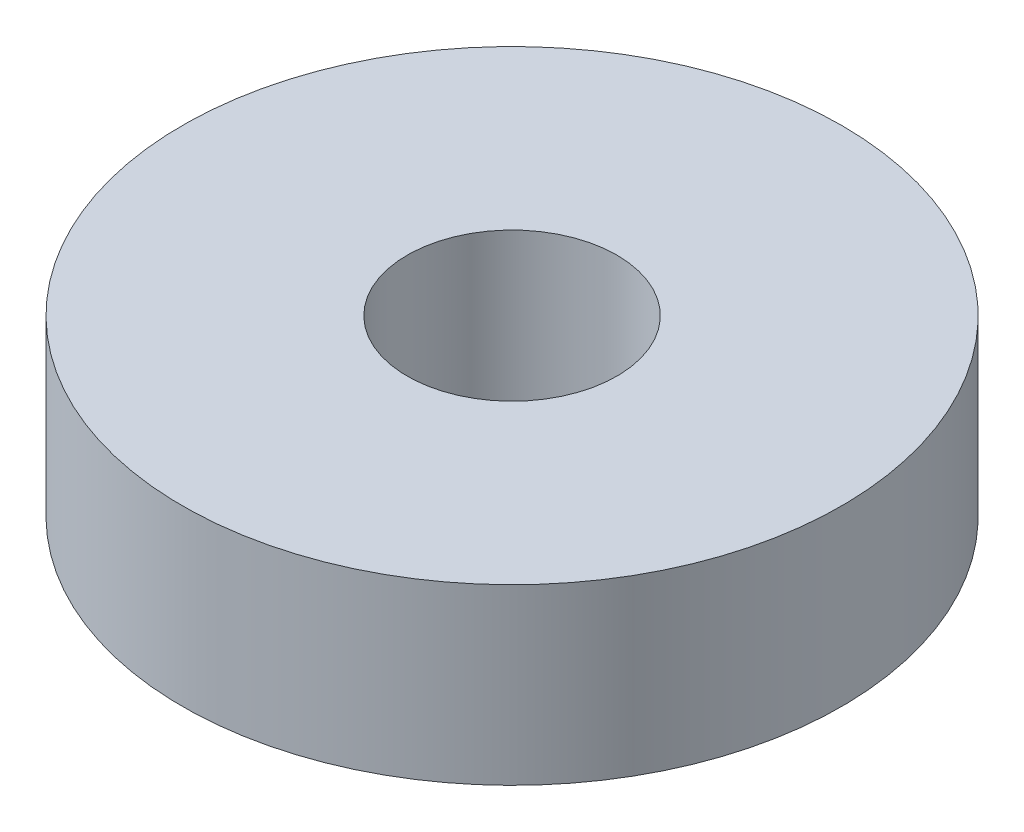
ISO-10303-21;
HEADER;
FILE_DESCRIPTION(('STEP AP214'),'2;1');
FILE_NAME('part.step','',(''),(''),'','','');
FILE_SCHEMA(('AUTOMOTIVE_DESIGN { 1 0 10303 214 1 1 1 1 }'));
ENDSEC;
DATA;
#1=APPLICATION_CONTEXT('core data for automotive mechanical design processes');
#2=APPLICATION_PROTOCOL_DEFINITION('international standard','automotive_design',2000,#1);
#3=PRODUCT_CONTEXT('',#1,'mechanical');
#4=PRODUCT('Part','Part','',(#3));
#5=PRODUCT_RELATED_PRODUCT_CATEGORY('part','',(#4));
#6=PRODUCT_DEFINITION_FORMATION('','',#4);
#7=PRODUCT_DEFINITION_CONTEXT('part definition',#1,'design');
#8=PRODUCT_DEFINITION('design','',#6,#7);
#9=PRODUCT_DEFINITION_SHAPE('','',#8);
#10=(LENGTH_UNIT() NAMED_UNIT(*) SI_UNIT(.MILLI.,.METRE.));
#11=(NAMED_UNIT(*) PLANE_ANGLE_UNIT() SI_UNIT($,.RADIAN.));
#12=(NAMED_UNIT(*) SI_UNIT($,.STERADIAN.) SOLID_ANGLE_UNIT());
#13=UNCERTAINTY_MEASURE_WITH_UNIT(LENGTH_MEASURE(1.E-05),#10,'distance_accuracy_value','');
#14=(GEOMETRIC_REPRESENTATION_CONTEXT(3) GLOBAL_UNCERTAINTY_ASSIGNED_CONTEXT((#13)) GLOBAL_UNIT_ASSIGNED_CONTEXT((#10,
#11,#12)) REPRESENTATION_CONTEXT('',''));
#15=CARTESIAN_POINT('',(0.,0.,0.));
#16=DIRECTION('',(0.,0.,1.));
#17=DIRECTION('',(1.,0.,0.));
#18=AXIS2_PLACEMENT_3D('',#15,#16,#17);
#19=CARTESIAN_POINT('',(0.,29.,0.));
#20=DIRECTION('',(0.,-1.,0.));
#21=DIRECTION('',(0.,0.,-1.));
#22=AXIS2_PLACEMENT_3D('',#19,#20,#21);
#23=CYLINDRICAL_SURFACE('',#22,55.);
#24=CARTESIAN_POINT('',(0.,29.,0.));
#25=DIRECTION('',(0.,1.,0.));
#26=DIRECTION('',(0.,0.,1.));
#27=AXIS2_PLACEMENT_3D('',#24,#25,#26);
#28=CIRCLE('',#27,55.);
#29=CARTESIAN_POINT('',(0.,29.,-55.));
#30=VERTEX_POINT('',#29);
#31=EDGE_CURVE('E10',#30,#30,#28,.T.);
#32=CARTESIAN_POINT('',(0.,0.,0.));
#33=DIRECTION('',(0.,1.,0.));
#34=DIRECTION('',(0.,0.,1.));
#35=AXIS2_PLACEMENT_3D('',#32,#33,#34);
#36=CIRCLE('',#35,55.);
#37=CARTESIAN_POINT('',(0.,0.,-55.));
#38=VERTEX_POINT('',#37);
#39=EDGE_CURVE('E37',#38,#38,#36,.T.);
#40=CARTESIAN_POINT('',(0.,29.,-55.));
#41=CARTESIAN_POINT('',(0.,28.6979166666667,-55.));
#42=CARTESIAN_POINT('',(0.,28.3958333333333,-55.));
#43=CARTESIAN_POINT('',(0.,27.7916666666667,-55.));
#44=CARTESIAN_POINT('',(0.,27.4895833333333,-55.));
#45=CARTESIAN_POINT('',(0.,26.8854166666667,-55.));
#46=CARTESIAN_POINT('',(0.,26.5833333333333,-55.));
#47=CARTESIAN_POINT('',(0.,25.9791666666667,-55.));
#48=CARTESIAN_POINT('',(0.,25.6770833333333,-55.));
#49=CARTESIAN_POINT('',(0.,25.0729166666667,-55.));
#50=CARTESIAN_POINT('',(0.,24.7708333333333,-55.));
#51=CARTESIAN_POINT('',(0.,24.1666666666667,-55.));
#52=CARTESIAN_POINT('',(0.,23.8645833333333,-55.));
#53=CARTESIAN_POINT('',(0.,23.2604166666667,-55.));
#54=CARTESIAN_POINT('',(0.,22.9583333333333,-55.));
#55=CARTESIAN_POINT('',(0.,22.3541666666667,-55.));
#56=CARTESIAN_POINT('',(0.,22.0520833333333,-55.));
#57=CARTESIAN_POINT('',(0.,21.4479166666667,-55.));
#58=CARTESIAN_POINT('',(0.,21.1458333333333,-55.));
#59=CARTESIAN_POINT('',(0.,20.5416666666667,-55.));
#60=CARTESIAN_POINT('',(0.,20.2395833333333,-55.));
#61=CARTESIAN_POINT('',(0.,19.6354166666667,-55.));
#62=CARTESIAN_POINT('',(0.,19.3333333333333,-55.));
#63=CARTESIAN_POINT('',(0.,18.7291666666667,-55.));
#64=CARTESIAN_POINT('',(0.,18.4270833333333,-55.));
#65=CARTESIAN_POINT('',(0.,17.8229166666667,-55.));
#66=CARTESIAN_POINT('',(0.,17.5208333333333,-55.));
#67=CARTESIAN_POINT('',(0.,16.9166666666667,-55.));
#68=CARTESIAN_POINT('',(0.,16.6145833333333,-55.));
#69=CARTESIAN_POINT('',(0.,16.0104166666667,-55.));
#70=CARTESIAN_POINT('',(0.,15.7083333333333,-55.));
#71=CARTESIAN_POINT('',(0.,15.1041666666667,-55.));
#72=CARTESIAN_POINT('',(0.,14.8020833333333,-55.));
#73=CARTESIAN_POINT('',(0.,14.1979166666667,-55.));
#74=CARTESIAN_POINT('',(0.,13.8958333333333,-55.));
#75=CARTESIAN_POINT('',(0.,13.2916666666667,-55.));
#76=CARTESIAN_POINT('',(0.,12.9895833333333,-55.));
#77=CARTESIAN_POINT('',(0.,12.3854166666667,-55.));
#78=CARTESIAN_POINT('',(0.,12.0833333333333,-55.));
#79=CARTESIAN_POINT('',(0.,11.4791666666667,-55.));
#80=CARTESIAN_POINT('',(0.,11.1770833333333,-55.));
#81=CARTESIAN_POINT('',(0.,10.5729166666667,-55.));
#82=CARTESIAN_POINT('',(0.,10.2708333333333,-55.));
#83=CARTESIAN_POINT('',(0.,9.66666666666667,-55.));
#84=CARTESIAN_POINT('',(0.,9.36458333333333,-55.));
#85=CARTESIAN_POINT('',(0.,8.76041666666667,-55.));
#86=CARTESIAN_POINT('',(0.,8.45833333333333,-55.));
#87=CARTESIAN_POINT('',(0.,7.85416666666667,-55.));
#88=CARTESIAN_POINT('',(0.,7.55208333333333,-55.));
#89=CARTESIAN_POINT('',(0.,6.94791666666667,-55.));
#90=CARTESIAN_POINT('',(0.,6.64583333333333,-55.));
#91=CARTESIAN_POINT('',(0.,6.04166666666667,-55.));
#92=CARTESIAN_POINT('',(0.,5.73958333333333,-55.));
#93=CARTESIAN_POINT('',(0.,5.13541666666667,-55.));
#94=CARTESIAN_POINT('',(0.,4.83333333333333,-55.));
#95=CARTESIAN_POINT('',(0.,4.22916666666667,-55.));
#96=CARTESIAN_POINT('',(0.,3.92708333333333,-55.));
#97=CARTESIAN_POINT('',(0.,3.32291666666667,-55.));
#98=CARTESIAN_POINT('',(0.,3.02083333333333,-55.));
#99=CARTESIAN_POINT('',(0.,2.41666666666667,-55.));
#100=CARTESIAN_POINT('',(0.,2.11458333333333,-55.));
#101=CARTESIAN_POINT('',(0.,1.51041666666667,-55.));
#102=CARTESIAN_POINT('',(0.,1.20833333333333,-55.));
#103=CARTESIAN_POINT('',(0.,0.604166666666667,-55.));
#104=CARTESIAN_POINT('',(0.,0.302083333333333,-55.));
#105=CARTESIAN_POINT('',(0.,0.,-55.));
#106=B_SPLINE_CURVE_WITH_KNOTS('',3,(#40,#41,#42,#43,#44,#45,#46,#47,#48,#49,#50,#51,#52,#53,
#54,#55,#56,#57,#58,#59,#60,#61,#62,#63,#64,#65,#66,#67,#68,#69,#70,#71,#72,#73,#74,#75,#76,#77,
#78,#79,#80,#81,#82,#83,#84,#85,#86,#87,#88,#89,#90,#91,#92,#93,#94,#95,#96,#97,#98,#99,#100,
#101,#102,#103,#104,#105),.UNSPECIFIED.,.F.,.F.,(4,2,2,2,2,2,2,2,2,2,2,2,2,2,2,2,2,2,2,2,2,2,2,
2,2,2,2,2,2,2,2,2,4),(0.,0.906250000000001,1.8125,2.71875,3.625,4.53125,5.4375,6.34375,7.25,
8.15625,9.0625,9.96875,10.875,11.78125,12.6875,13.59375,14.5,15.40625,16.3125,17.21875,18.125,
19.03125,19.9375,20.84375,21.75,22.65625,23.5625,24.46875,25.375,26.28125,27.1875,28.09375,29.),.UNSPECIFIED.);
#107=EDGE_CURVE('BSEAM40',#30,#38,#106,.T.);
#108=ORIENTED_EDGE('',*,*,#31,.F.);
#109=ORIENTED_EDGE('',*,*,#39,.T.);
#110=ORIENTED_EDGE('',*,*,#107,.T.);
#111=ORIENTED_EDGE('',*,*,#107,.F.);
#112=EDGE_LOOP('',(#108,#110,#109,#111));
#113=FACE_BOUND('',#112,.T.);
#114=ADVANCED_FACE('F40',(#113),#23,.T.);
#115=CARTESIAN_POINT('',(0.,29.,0.));
#116=DIRECTION('',(0.,1.,0.));
#117=DIRECTION('',(0.,0.,1.));
#118=AXIS2_PLACEMENT_3D('',#115,#116,#117);
#119=PLANE('',#118);
#120=CARTESIAN_POINT('',(0.,29.,0.));
#121=DIRECTION('',(0.,1.,0.));
#122=DIRECTION('',(0.,0.,1.));
#123=AXIS2_PLACEMENT_3D('',#120,#121,#122);
#124=CIRCLE('',#123,17.5);
#125=CARTESIAN_POINT('',(0.,29.,-17.5));
#126=VERTEX_POINT('',#125);
#127=EDGE_CURVE('E50',#126,#126,#124,.T.);
#128=ORIENTED_EDGE('',*,*,#127,.F.);
#129=EDGE_LOOP('',(#128));
#130=FACE_BOUND('',#129,.T.);
#131=ORIENTED_EDGE('',*,*,#31,.T.);
#132=EDGE_LOOP('',(#131));
#133=FACE_BOUND('',#132,.T.);
#134=ADVANCED_FACE('F59',(#130,#133),#119,.T.);
#135=CARTESIAN_POINT('',(0.,0.,0.));
#136=DIRECTION('',(0.,1.,0.));
#137=DIRECTION('',(0.,0.,1.));
#138=AXIS2_PLACEMENT_3D('',#135,#136,#137);
#139=PLANE('',#138);
#140=CARTESIAN_POINT('',(0.,0.,0.));
#141=DIRECTION('',(0.,1.,0.));
#142=DIRECTION('',(0.,0.,1.));
#143=AXIS2_PLACEMENT_3D('',#140,#141,#142);
#144=CIRCLE('',#143,17.5);
#145=CARTESIAN_POINT('',(0.,0.,-17.5));
#146=VERTEX_POINT('',#145);
#147=EDGE_CURVE('E47',#146,#146,#144,.T.);
#148=ORIENTED_EDGE('',*,*,#147,.T.);
#149=EDGE_LOOP('',(#148));
#150=FACE_BOUND('',#149,.T.);
#151=ORIENTED_EDGE('',*,*,#39,.F.);
#152=EDGE_LOOP('',(#151));
#153=FACE_BOUND('',#152,.T.);
#154=ADVANCED_FACE('F58',(#150,#153),#139,.F.);
#155=CARTESIAN_POINT('',(0.,29.,0.));
#156=DIRECTION('',(0.,-1.,0.));
#157=DIRECTION('',(0.,0.,-1.));
#158=AXIS2_PLACEMENT_3D('',#155,#156,#157);
#159=CYLINDRICAL_SURFACE('',#158,17.5);
#160=CARTESIAN_POINT('',(0.,29.,-17.5));
#161=CARTESIAN_POINT('',(0.,28.6979166666667,-17.5));
#162=CARTESIAN_POINT('',(0.,28.3958333333333,-17.5));
#163=CARTESIAN_POINT('',(0.,27.7916666666667,-17.5));
#164=CARTESIAN_POINT('',(0.,27.4895833333333,-17.5));
#165=CARTESIAN_POINT('',(0.,26.8854166666667,-17.5));
#166=CARTESIAN_POINT('',(0.,26.5833333333333,-17.5));
#167=CARTESIAN_POINT('',(0.,25.9791666666667,-17.5));
#168=CARTESIAN_POINT('',(0.,25.6770833333333,-17.5));
#169=CARTESIAN_POINT('',(0.,25.0729166666667,-17.5));
#170=CARTESIAN_POINT('',(0.,24.7708333333333,-17.5));
#171=CARTESIAN_POINT('',(0.,24.1666666666667,-17.5));
#172=CARTESIAN_POINT('',(0.,23.8645833333333,-17.5));
#173=CARTESIAN_POINT('',(0.,23.2604166666667,-17.5));
#174=CARTESIAN_POINT('',(0.,22.9583333333333,-17.5));
#175=CARTESIAN_POINT('',(0.,22.3541666666667,-17.5));
#176=CARTESIAN_POINT('',(0.,22.0520833333333,-17.5));
#177=CARTESIAN_POINT('',(0.,21.4479166666667,-17.5));
#178=CARTESIAN_POINT('',(0.,21.1458333333333,-17.5));
#179=CARTESIAN_POINT('',(0.,20.5416666666667,-17.5));
#180=CARTESIAN_POINT('',(0.,20.2395833333333,-17.5));
#181=CARTESIAN_POINT('',(0.,19.6354166666667,-17.5));
#182=CARTESIAN_POINT('',(0.,19.3333333333333,-17.5));
#183=CARTESIAN_POINT('',(0.,18.7291666666667,-17.5));
#184=CARTESIAN_POINT('',(0.,18.4270833333333,-17.5));
#185=CARTESIAN_POINT('',(0.,17.8229166666667,-17.5));
#186=CARTESIAN_POINT('',(0.,17.5208333333333,-17.5));
#187=CARTESIAN_POINT('',(0.,16.9166666666667,-17.5));
#188=CARTESIAN_POINT('',(0.,16.6145833333333,-17.5));
#189=CARTESIAN_POINT('',(0.,16.0104166666667,-17.5));
#190=CARTESIAN_POINT('',(0.,15.7083333333333,-17.5));
#191=CARTESIAN_POINT('',(0.,15.1041666666667,-17.5));
#192=CARTESIAN_POINT('',(0.,14.8020833333333,-17.5));
#193=CARTESIAN_POINT('',(0.,14.1979166666667,-17.5));
#194=CARTESIAN_POINT('',(0.,13.8958333333333,-17.5));
#195=CARTESIAN_POINT('',(0.,13.2916666666667,-17.5));
#196=CARTESIAN_POINT('',(0.,12.9895833333333,-17.5));
#197=CARTESIAN_POINT('',(0.,12.3854166666667,-17.5));
#198=CARTESIAN_POINT('',(0.,12.0833333333333,-17.5));
#199=CARTESIAN_POINT('',(0.,11.4791666666667,-17.5));
#200=CARTESIAN_POINT('',(0.,11.1770833333333,-17.5));
#201=CARTESIAN_POINT('',(0.,10.5729166666667,-17.5));
#202=CARTESIAN_POINT('',(0.,10.2708333333333,-17.5));
#203=CARTESIAN_POINT('',(0.,9.66666666666667,-17.5));
#204=CARTESIAN_POINT('',(0.,9.36458333333333,-17.5));
#205=CARTESIAN_POINT('',(0.,8.76041666666667,-17.5));
#206=CARTESIAN_POINT('',(0.,8.45833333333333,-17.5));
#207=CARTESIAN_POINT('',(0.,7.85416666666667,-17.5));
#208=CARTESIAN_POINT('',(0.,7.55208333333333,-17.5));
#209=CARTESIAN_POINT('',(0.,6.94791666666667,-17.5));
#210=CARTESIAN_POINT('',(0.,6.64583333333333,-17.5));
#211=CARTESIAN_POINT('',(0.,6.04166666666667,-17.5));
#212=CARTESIAN_POINT('',(0.,5.73958333333333,-17.5));
#213=CARTESIAN_POINT('',(0.,5.13541666666667,-17.5));
#214=CARTESIAN_POINT('',(0.,4.83333333333333,-17.5));
#215=CARTESIAN_POINT('',(0.,4.22916666666667,-17.5));
#216=CARTESIAN_POINT('',(0.,3.92708333333333,-17.5));
#217=CARTESIAN_POINT('',(0.,3.32291666666667,-17.5));
#218=CARTESIAN_POINT('',(0.,3.02083333333333,-17.5));
#219=CARTESIAN_POINT('',(0.,2.41666666666667,-17.5));
#220=CARTESIAN_POINT('',(0.,2.11458333333333,-17.5));
#221=CARTESIAN_POINT('',(0.,1.51041666666667,-17.5));
#222=CARTESIAN_POINT('',(0.,1.20833333333333,-17.5));
#223=CARTESIAN_POINT('',(0.,0.604166666666667,-17.5));
#224=CARTESIAN_POINT('',(0.,0.302083333333333,-17.5));
#225=CARTESIAN_POINT('',(0.,0.,-17.5));
#226=B_SPLINE_CURVE_WITH_KNOTS('',3,(#160,#161,#162,#163,#164,#165,#166,#167,#168,#169,#170,
#171,#172,#173,#174,#175,#176,#177,#178,#179,#180,#181,#182,#183,#184,#185,#186,#187,#188,#189,
#190,#191,#192,#193,#194,#195,#196,#197,#198,#199,#200,#201,#202,#203,#204,#205,#206,#207,#208,
#209,#210,#211,#212,#213,#214,#215,#216,#217,#218,#219,#220,#221,#222,#223,#224,#225),
.UNSPECIFIED.,.F.,.F.,(4,2,2,2,2,2,2,2,2,2,2,2,2,2,2,2,2,2,2,2,2,2,2,2,2,2,2,2,2,2,2,2,4),(0.,
0.906249999999997,1.8125,2.71875,3.625,4.53125,5.4375,6.34375,7.25,8.15625,9.0625,9.96875,
10.875,11.78125,12.6875,13.59375,14.5,15.40625,16.3125,17.21875,18.125,19.03125,19.9375,
20.84375,21.75,22.65625,23.5625,24.46875,25.375,26.28125,27.1875,28.09375,29.),.UNSPECIFIED.);
#227=EDGE_CURVE('BSEAM54',#126,#146,#226,.T.);
#228=ORIENTED_EDGE('',*,*,#127,.T.);
#229=ORIENTED_EDGE('',*,*,#147,.F.);
#230=ORIENTED_EDGE('',*,*,#227,.T.);
#231=ORIENTED_EDGE('',*,*,#227,.F.);
#232=EDGE_LOOP('',(#228,#230,#229,#231));
#233=FACE_BOUND('',#232,.T.);
#234=ADVANCED_FACE('F54',(#233),#159,.F.);
#235=CLOSED_SHELL('',(#114,#134,#154,#234));
#236=MANIFOLD_SOLID_BREP('B2',#235);
#237=ADVANCED_BREP_SHAPE_REPRESENTATION('',(#18,#236),#14);
#238=SHAPE_DEFINITION_REPRESENTATION(#9,#237);
ENDSEC;
END-ISO-10303-21;
